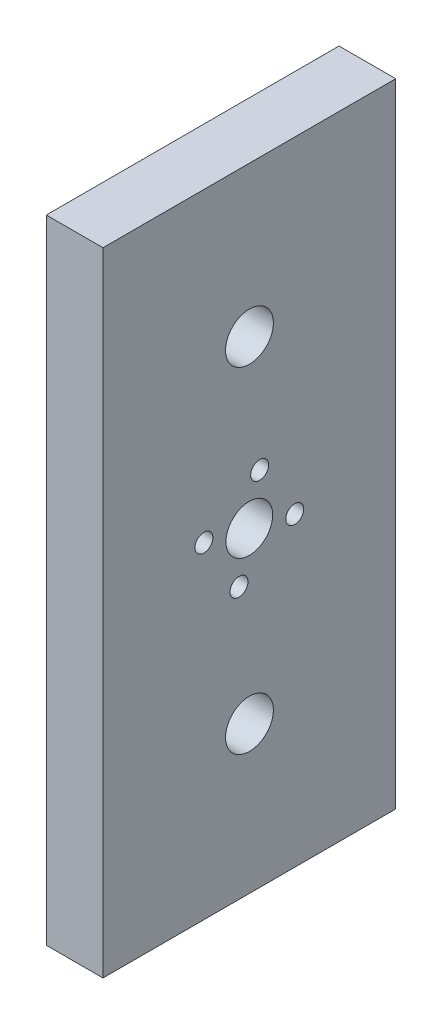
ISO-10303-21;
HEADER;
FILE_DESCRIPTION(('STEP AP214'),'2;1');
FILE_NAME('part.step','',(''),(''),'','','');
FILE_SCHEMA(('AUTOMOTIVE_DESIGN { 1 0 10303 214 1 1 1 1 }'));
ENDSEC;
DATA;
#1=APPLICATION_CONTEXT('core data for automotive mechanical design processes');
#2=APPLICATION_PROTOCOL_DEFINITION('international standard','automotive_design',2000,#1);
#3=PRODUCT_CONTEXT('',#1,'mechanical');
#4=PRODUCT('Part','Part','',(#3));
#5=PRODUCT_RELATED_PRODUCT_CATEGORY('part','',(#4));
#6=PRODUCT_DEFINITION_FORMATION('','',#4);
#7=PRODUCT_DEFINITION_CONTEXT('part definition',#1,'design');
#8=PRODUCT_DEFINITION('design','',#6,#7);
#9=PRODUCT_DEFINITION_SHAPE('','',#8);
#10=(LENGTH_UNIT() NAMED_UNIT(*) SI_UNIT(.MILLI.,.METRE.));
#11=(NAMED_UNIT(*) PLANE_ANGLE_UNIT() SI_UNIT($,.RADIAN.));
#12=(NAMED_UNIT(*) SI_UNIT($,.STERADIAN.) SOLID_ANGLE_UNIT());
#13=UNCERTAINTY_MEASURE_WITH_UNIT(LENGTH_MEASURE(1.E-05),#10,'distance_accuracy_value','');
#14=(GEOMETRIC_REPRESENTATION_CONTEXT(3) GLOBAL_UNCERTAINTY_ASSIGNED_CONTEXT((#13)) GLOBAL_UNIT_ASSIGNED_CONTEXT((#10,
#11,#12)) REPRESENTATION_CONTEXT('',''));
#15=CARTESIAN_POINT('',(0.,0.,0.));
#16=DIRECTION('',(0.,0.,1.));
#17=DIRECTION('',(1.,0.,0.));
#18=AXIS2_PLACEMENT_3D('',#15,#16,#17);
#19=CARTESIAN_POINT('',(10.,-434.064948576909,-442.796456133035));
#20=DIRECTION('',(0.,0.,1.));
#21=DIRECTION('',(1.,0.,0.));
#22=AXIS2_PLACEMENT_3D('',#19,#20,#21);
#23=PLANE('',#22);
#24=DIRECTION('',(0.,1.,0.));
#25=VECTOR('',#24,1.);
#26=CARTESIAN_POINT('',(0.,-434.064948576909,-442.796456133035));
#27=LINE('',#26,#25);
#28=CARTESIAN_POINT('',(0.,-545.69491443898,-442.796456133035));
#29=VERTEX_POINT('',#28);
#30=CARTESIAN_POINT('',(0.,-434.064948576909,-442.796456133035));
#31=VERTEX_POINT('',#30);
#32=EDGE_CURVE('E100',#29,#31,#27,.T.);
#33=ORIENTED_EDGE('',*,*,#32,.T.);
#34=DIRECTION('',(-1.,0.,0.));
#35=VECTOR('',#34,1.);
#36=CARTESIAN_POINT('',(10.,-434.064948576909,-442.796456133035));
#37=LINE('',#36,#35);
#38=CARTESIAN_POINT('',(10.,-434.064948576909,-442.796456133035));
#39=VERTEX_POINT('',#38);
#40=EDGE_CURVE('E11',#39,#31,#37,.T.);
#41=ORIENTED_EDGE('',*,*,#40,.F.);
#42=DIRECTION('',(0.,1.,0.));
#43=VECTOR('',#42,1.);
#44=CARTESIAN_POINT('',(10.,-434.064948576909,-442.796456133035));
#45=LINE('',#44,#43);
#46=CARTESIAN_POINT('',(10.,-545.69491443898,-442.796456133035));
#47=VERTEX_POINT('',#46);
#48=EDGE_CURVE('E88',#47,#39,#45,.T.);
#49=ORIENTED_EDGE('',*,*,#48,.F.);
#50=DIRECTION('',(-1.,0.,0.));
#51=VECTOR('',#50,1.);
#52=CARTESIAN_POINT('',(10.,-545.69491443898,-442.796456133035));
#53=LINE('',#52,#51);
#54=EDGE_CURVE('E96',#47,#29,#53,.T.);
#55=ORIENTED_EDGE('',*,*,#54,.T.);
#56=EDGE_LOOP('',(#33,#41,#49,#55));
#57=FACE_BOUND('',#56,.T.);
#58=ADVANCED_FACE('F37',(#57),#23,.F.);
#59=CARTESIAN_POINT('',(10.,-434.064948576909,-391.125660396535));
#60=DIRECTION('',(0.,-1.,0.));
#61=DIRECTION('',(0.,0.,-1.));
#62=AXIS2_PLACEMENT_3D('',#59,#60,#61);
#63=PLANE('',#62);
#64=DIRECTION('',(0.,0.,1.));
#65=VECTOR('',#64,1.);
#66=CARTESIAN_POINT('',(0.,-434.064948576909,-391.125660396535));
#67=LINE('',#66,#65);
#68=CARTESIAN_POINT('',(0.,-434.064948576909,-391.125660396535));
#69=VERTEX_POINT('',#68);
#70=EDGE_CURVE('E92',#31,#69,#67,.T.);
#71=ORIENTED_EDGE('',*,*,#70,.T.);
#72=DIRECTION('',(-1.,0.,0.));
#73=VECTOR('',#72,1.);
#74=CARTESIAN_POINT('',(10.,-434.064948576909,-391.125660396535));
#75=LINE('',#74,#73);
#76=CARTESIAN_POINT('',(10.,-434.064948576909,-391.125660396535));
#77=VERTEX_POINT('',#76);
#78=EDGE_CURVE('E45',#77,#69,#75,.T.);
#79=ORIENTED_EDGE('',*,*,#78,.F.);
#80=DIRECTION('',(0.,0.,1.));
#81=VECTOR('',#80,1.);
#82=CARTESIAN_POINT('',(10.,-434.064948576909,-391.125660396535));
#83=LINE('',#82,#81);
#84=EDGE_CURVE('E83',#39,#77,#83,.T.);
#85=ORIENTED_EDGE('',*,*,#84,.F.);
#86=ORIENTED_EDGE('',*,*,#40,.T.);
#87=EDGE_LOOP('',(#71,#79,#85,#86));
#88=FACE_BOUND('',#87,.T.);
#89=ADVANCED_FACE('F91',(#88),#63,.F.);
#90=CARTESIAN_POINT('',(10.,-434.064948576909,-391.125660396535));
#91=DIRECTION('',(0.,0.,-1.));
#92=DIRECTION('',(-1.,0.,0.));
#93=AXIS2_PLACEMENT_3D('',#90,#91,#92);
#94=PLANE('',#93);
#95=DIRECTION('',(0.,-1.,0.));
#96=VECTOR('',#95,1.);
#97=CARTESIAN_POINT('',(0.,-434.064948576909,-391.125660396535));
#98=LINE('',#97,#96);
#99=CARTESIAN_POINT('',(0.,-545.69491443898,-391.125660396535));
#100=VERTEX_POINT('',#99);
#101=EDGE_CURVE('E70',#69,#100,#98,.T.);
#102=ORIENTED_EDGE('',*,*,#101,.T.);
#103=DIRECTION('',(-1.,0.,0.));
#104=VECTOR('',#103,1.);
#105=CARTESIAN_POINT('',(10.,-545.69491443898,-391.125660396535));
#106=LINE('',#105,#104);
#107=CARTESIAN_POINT('',(10.,-545.69491443898,-391.125660396535));
#108=VERTEX_POINT('',#107);
#109=EDGE_CURVE('E93',#108,#100,#106,.T.);
#110=ORIENTED_EDGE('',*,*,#109,.F.);
#111=DIRECTION('',(0.,-1.,0.));
#112=VECTOR('',#111,1.);
#113=CARTESIAN_POINT('',(10.,-434.064948576909,-391.125660396535));
#114=LINE('',#113,#112);
#115=EDGE_CURVE('E86',#77,#108,#114,.T.);
#116=ORIENTED_EDGE('',*,*,#115,.F.);
#117=ORIENTED_EDGE('',*,*,#78,.T.);
#118=EDGE_LOOP('',(#102,#110,#116,#117));
#119=FACE_BOUND('',#118,.T.);
#120=ADVANCED_FACE('F94',(#119),#94,.F.);
#121=CARTESIAN_POINT('',(10.,-545.69491443898,-391.125660396535));
#122=DIRECTION('',(0.,1.,0.));
#123=DIRECTION('',(0.,0.,1.));
#124=AXIS2_PLACEMENT_3D('',#121,#122,#123);
#125=PLANE('',#124);
#126=DIRECTION('',(0.,0.,-1.));
#127=VECTOR('',#126,1.);
#128=CARTESIAN_POINT('',(0.,-545.69491443898,-391.125660396535));
#129=LINE('',#128,#127);
#130=EDGE_CURVE('E76',#100,#29,#129,.T.);
#131=ORIENTED_EDGE('',*,*,#130,.T.);
#132=ORIENTED_EDGE('',*,*,#54,.F.);
#133=DIRECTION('',(0.,0.,-1.));
#134=VECTOR('',#133,1.);
#135=CARTESIAN_POINT('',(10.,-545.69491443898,-391.125660396535));
#136=LINE('',#135,#134);
#137=EDGE_CURVE('E53',#108,#47,#136,.T.);
#138=ORIENTED_EDGE('',*,*,#137,.F.);
#139=ORIENTED_EDGE('',*,*,#109,.T.);
#140=EDGE_LOOP('',(#131,#132,#138,#139));
#141=FACE_BOUND('',#140,.T.);
#142=ADVANCED_FACE('F108',(#141),#125,.F.);
#143=CARTESIAN_POINT('',(10.,0.,0.));
#144=DIRECTION('',(1.,0.,0.));
#145=DIRECTION('',(0.,0.,-1.));
#146=AXIS2_PLACEMENT_3D('',#143,#144,#145);
#147=PLANE('',#146);
#148=CARTESIAN_POINT('',(10.,-481.859784241194,-418.785735610491));
#149=DIRECTION('',(1.,0.,0.));
#150=DIRECTION('',(0.,0.,-1.));
#151=AXIS2_PLACEMENT_3D('',#148,#149,#150);
#152=CIRCLE('',#151,1.58750000000004);
#153=CARTESIAN_POINT('',(10.,-481.859784241194,-420.373235610492));
#154=VERTEX_POINT('',#153);
#155=EDGE_CURVE('E150',#154,#154,#152,.T.);
#156=ORIENTED_EDGE('',*,*,#155,.F.);
#157=EDGE_LOOP('',(#156));
#158=FACE_BOUND('',#157,.T.);
#159=CARTESIAN_POINT('',(10.,-491.704497776385,-424.981126268878));
#160=DIRECTION('',(1.,0.,0.));
#161=DIRECTION('',(0.,0.,-1.));
#162=AXIS2_PLACEMENT_3D('',#159,#160,#161);
#163=CIRCLE('',#162,1.58750000000004);
#164=CARTESIAN_POINT('',(10.,-491.704497776385,-426.568626268878));
#165=VERTEX_POINT('',#164);
#166=EDGE_CURVE('E147',#165,#165,#163,.T.);
#167=ORIENTED_EDGE('',*,*,#166,.F.);
#168=EDGE_LOOP('',(#167));
#169=FACE_BOUND('',#168,.T.);
#170=CARTESIAN_POINT('',(10.,-497.899888434771,-415.136412733686));
#171=DIRECTION('',(1.,0.,0.));
#172=DIRECTION('',(0.,0.,-1.));
#173=AXIS2_PLACEMENT_3D('',#170,#171,#172);
#174=CIRCLE('',#173,1.58750000000004);
#175=CARTESIAN_POINT('',(10.,-497.899888434771,-416.723912733686));
#176=VERTEX_POINT('',#175);
#177=EDGE_CURVE('E141',#176,#176,#174,.T.);
#178=ORIENTED_EDGE('',*,*,#177,.F.);
#179=EDGE_LOOP('',(#178));
#180=FACE_BOUND('',#179,.T.);
#181=CARTESIAN_POINT('',(10.,-488.05517489958,-408.9410220753));
#182=DIRECTION('',(1.,0.,0.));
#183=DIRECTION('',(0.,0.,-1.));
#184=AXIS2_PLACEMENT_3D('',#181,#182,#183);
#185=CIRCLE('',#184,1.58750000000004);
#186=CARTESIAN_POINT('',(10.,-488.05517489958,-410.5285220753));
#187=VERTEX_POINT('',#186);
#188=EDGE_CURVE('E135',#187,#187,#185,.T.);
#189=ORIENTED_EDGE('',*,*,#188,.F.);
#190=EDGE_LOOP('',(#189));
#191=FACE_BOUND('',#190,.T.);
#192=CARTESIAN_POINT('',(10.,-460.578730031809,-416.982623845333));
#193=DIRECTION('',(1.,0.,0.));
#194=DIRECTION('',(0.,0.,-1.));
#195=AXIS2_PLACEMENT_3D('',#192,#193,#194);
#196=CIRCLE('',#195,4.225);
#197=CARTESIAN_POINT('',(10.,-460.578730031809,-421.207623845333));
#198=VERTEX_POINT('',#197);
#199=EDGE_CURVE('E127',#198,#198,#196,.T.);
#200=ORIENTED_EDGE('',*,*,#199,.F.);
#201=EDGE_LOOP('',(#200));
#202=FACE_BOUND('',#201,.T.);
#203=CARTESIAN_POINT('',(10.,-519.760730031808,-416.982623845334));
#204=DIRECTION('',(1.,0.,0.));
#205=DIRECTION('',(0.,0.,-1.));
#206=AXIS2_PLACEMENT_3D('',#203,#204,#205);
#207=CIRCLE('',#206,4.22499999999998);
#208=CARTESIAN_POINT('',(10.,-519.760730031808,-421.207623845334));
#209=VERTEX_POINT('',#208);
#210=EDGE_CURVE('E124',#209,#209,#207,.T.);
#211=ORIENTED_EDGE('',*,*,#210,.F.);
#212=EDGE_LOOP('',(#211));
#213=FACE_BOUND('',#212,.T.);
#214=CARTESIAN_POINT('',(10.,-489.879931507944,-416.961058264785));
#215=DIRECTION('',(1.,0.,0.));
#216=DIRECTION('',(0.,0.,-1.));
#217=AXIS2_PLACEMENT_3D('',#214,#215,#216);
#218=CIRCLE('',#217,4.1275);
#219=CARTESIAN_POINT('',(10.,-489.879931507944,-421.088558264785));
#220=VERTEX_POINT('',#219);
#221=EDGE_CURVE('E117',#220,#220,#218,.T.);
#222=ORIENTED_EDGE('',*,*,#221,.F.);
#223=EDGE_LOOP('',(#222));
#224=FACE_BOUND('',#223,.T.);
#225=ORIENTED_EDGE('',*,*,#48,.T.);
#226=ORIENTED_EDGE('',*,*,#84,.T.);
#227=ORIENTED_EDGE('',*,*,#115,.T.);
#228=ORIENTED_EDGE('',*,*,#137,.T.);
#229=EDGE_LOOP('',(#225,#226,#227,#228));
#230=FACE_BOUND('',#229,.T.);
#231=ADVANCED_FACE('F84',(#158,#169,#180,#191,#202,#213,#224,#230),#147,.T.);
#232=CARTESIAN_POINT('',(0.,0.,0.));
#233=DIRECTION('',(1.,0.,0.));
#234=DIRECTION('',(0.,0.,-1.));
#235=AXIS2_PLACEMENT_3D('',#232,#233,#234);
#236=PLANE('',#235);
#237=CARTESIAN_POINT('',(0.,-481.859784241194,-418.785735610491));
#238=DIRECTION('',(1.,0.,0.));
#239=DIRECTION('',(0.,0.,-1.));
#240=AXIS2_PLACEMENT_3D('',#237,#238,#239);
#241=CIRCLE('',#240,1.58750000000004);
#242=CARTESIAN_POINT('',(0.,-481.859784241194,-420.373235610492));
#243=VERTEX_POINT('',#242);
#244=EDGE_CURVE('E118',#243,#243,#241,.T.);
#245=ORIENTED_EDGE('',*,*,#244,.T.);
#246=EDGE_LOOP('',(#245));
#247=FACE_BOUND('',#246,.T.);
#248=CARTESIAN_POINT('',(0.,-491.704497776385,-424.981126268878));
#249=DIRECTION('',(1.,0.,0.));
#250=DIRECTION('',(0.,0.,-1.));
#251=AXIS2_PLACEMENT_3D('',#248,#249,#250);
#252=CIRCLE('',#251,1.58750000000004);
#253=CARTESIAN_POINT('',(0.,-491.704497776385,-426.568626268878));
#254=VERTEX_POINT('',#253);
#255=EDGE_CURVE('E144',#254,#254,#252,.T.);
#256=ORIENTED_EDGE('',*,*,#255,.T.);
#257=EDGE_LOOP('',(#256));
#258=FACE_BOUND('',#257,.T.);
#259=CARTESIAN_POINT('',(0.,-497.899888434771,-415.136412733686));
#260=DIRECTION('',(1.,0.,0.));
#261=DIRECTION('',(0.,0.,-1.));
#262=AXIS2_PLACEMENT_3D('',#259,#260,#261);
#263=CIRCLE('',#262,1.58750000000004);
#264=CARTESIAN_POINT('',(0.,-497.899888434771,-416.723912733686));
#265=VERTEX_POINT('',#264);
#266=EDGE_CURVE('E138',#265,#265,#263,.T.);
#267=ORIENTED_EDGE('',*,*,#266,.T.);
#268=EDGE_LOOP('',(#267));
#269=FACE_BOUND('',#268,.T.);
#270=CARTESIAN_POINT('',(0.,-488.05517489958,-408.9410220753));
#271=DIRECTION('',(1.,0.,0.));
#272=DIRECTION('',(0.,0.,-1.));
#273=AXIS2_PLACEMENT_3D('',#270,#271,#272);
#274=CIRCLE('',#273,1.58750000000004);
#275=CARTESIAN_POINT('',(0.,-488.05517489958,-410.5285220753));
#276=VERTEX_POINT('',#275);
#277=EDGE_CURVE('E132',#276,#276,#274,.T.);
#278=ORIENTED_EDGE('',*,*,#277,.T.);
#279=EDGE_LOOP('',(#278));
#280=FACE_BOUND('',#279,.T.);
#281=CARTESIAN_POINT('',(0.,-460.578730031809,-416.982623845333));
#282=DIRECTION('',(1.,0.,0.));
#283=DIRECTION('',(0.,0.,-1.));
#284=AXIS2_PLACEMENT_3D('',#281,#282,#283);
#285=CIRCLE('',#284,4.225);
#286=CARTESIAN_POINT('',(0.,-460.578730031809,-421.207623845333));
#287=VERTEX_POINT('',#286);
#288=EDGE_CURVE('E103',#287,#287,#285,.T.);
#289=ORIENTED_EDGE('',*,*,#288,.T.);
#290=EDGE_LOOP('',(#289));
#291=FACE_BOUND('',#290,.T.);
#292=CARTESIAN_POINT('',(0.,-519.760730031808,-416.982623845334));
#293=DIRECTION('',(1.,0.,0.));
#294=DIRECTION('',(0.,0.,-1.));
#295=AXIS2_PLACEMENT_3D('',#292,#293,#294);
#296=CIRCLE('',#295,4.22499999999998);
#297=CARTESIAN_POINT('',(0.,-519.760730031808,-421.207623845334));
#298=VERTEX_POINT('',#297);
#299=EDGE_CURVE('E121',#298,#298,#296,.T.);
#300=ORIENTED_EDGE('',*,*,#299,.T.);
#301=EDGE_LOOP('',(#300));
#302=FACE_BOUND('',#301,.T.);
#303=CARTESIAN_POINT('',(0.,-489.879931507944,-416.961058264785));
#304=DIRECTION('',(1.,0.,0.));
#305=DIRECTION('',(0.,0.,-1.));
#306=AXIS2_PLACEMENT_3D('',#303,#304,#305);
#307=CIRCLE('',#306,4.1275);
#308=CARTESIAN_POINT('',(0.,-489.879931507944,-421.088558264785));
#309=VERTEX_POINT('',#308);
#310=EDGE_CURVE('E114',#309,#309,#307,.T.);
#311=ORIENTED_EDGE('',*,*,#310,.T.);
#312=EDGE_LOOP('',(#311));
#313=FACE_BOUND('',#312,.T.);
#314=ORIENTED_EDGE('',*,*,#32,.F.);
#315=ORIENTED_EDGE('',*,*,#130,.F.);
#316=ORIENTED_EDGE('',*,*,#101,.F.);
#317=ORIENTED_EDGE('',*,*,#70,.F.);
#318=EDGE_LOOP('',(#314,#315,#316,#317));
#319=FACE_BOUND('',#318,.T.);
#320=ADVANCED_FACE('F111',(#247,#258,#269,#280,#291,#302,#313,#319),#236,.F.);
#321=CARTESIAN_POINT('',(0.,-489.879931507944,-416.961058264785));
#322=DIRECTION('',(1.,0.,0.));
#323=DIRECTION('',(0.,0.,-1.));
#324=AXIS2_PLACEMENT_3D('',#321,#322,#323);
#325=CYLINDRICAL_SURFACE('',#324,4.1275);
#326=ORIENTED_EDGE('',*,*,#310,.F.);
#327=EDGE_LOOP('',(#326));
#328=FACE_BOUND('',#327,.T.);
#329=ORIENTED_EDGE('',*,*,#221,.T.);
#330=EDGE_LOOP('',(#329));
#331=FACE_BOUND('',#330,.T.);
#332=ADVANCED_FACE('F180',(#328,#331),#325,.F.);
#333=CARTESIAN_POINT('',(0.,-519.760730031808,-416.982623845334));
#334=DIRECTION('',(1.,0.,0.));
#335=DIRECTION('',(0.,0.,-1.));
#336=AXIS2_PLACEMENT_3D('',#333,#334,#335);
#337=CYLINDRICAL_SURFACE('',#336,4.22499999999998);
#338=ORIENTED_EDGE('',*,*,#299,.F.);
#339=EDGE_LOOP('',(#338));
#340=FACE_BOUND('',#339,.T.);
#341=ORIENTED_EDGE('',*,*,#210,.T.);
#342=EDGE_LOOP('',(#341));
#343=FACE_BOUND('',#342,.T.);
#344=ADVANCED_FACE('F182',(#340,#343),#337,.F.);
#345=CARTESIAN_POINT('',(0.,-460.578730031809,-416.982623845333));
#346=DIRECTION('',(1.,0.,0.));
#347=DIRECTION('',(0.,0.,-1.));
#348=AXIS2_PLACEMENT_3D('',#345,#346,#347);
#349=CYLINDRICAL_SURFACE('',#348,4.225);
#350=ORIENTED_EDGE('',*,*,#288,.F.);
#351=EDGE_LOOP('',(#350));
#352=FACE_BOUND('',#351,.T.);
#353=ORIENTED_EDGE('',*,*,#199,.T.);
#354=EDGE_LOOP('',(#353));
#355=FACE_BOUND('',#354,.T.);
#356=ADVANCED_FACE('F189',(#352,#355),#349,.F.);
#357=CARTESIAN_POINT('',(0.,-488.05517489958,-408.9410220753));
#358=DIRECTION('',(1.,0.,0.));
#359=DIRECTION('',(0.,0.,-1.));
#360=AXIS2_PLACEMENT_3D('',#357,#358,#359);
#361=CYLINDRICAL_SURFACE('',#360,1.58750000000004);
#362=ORIENTED_EDGE('',*,*,#277,.F.);
#363=EDGE_LOOP('',(#362));
#364=FACE_BOUND('',#363,.T.);
#365=ORIENTED_EDGE('',*,*,#188,.T.);
#366=EDGE_LOOP('',(#365));
#367=FACE_BOUND('',#366,.T.);
#368=ADVANCED_FACE('F224',(#364,#367),#361,.F.);
#369=CARTESIAN_POINT('',(0.,-497.899888434771,-415.136412733686));
#370=DIRECTION('',(1.,0.,0.));
#371=DIRECTION('',(0.,0.,-1.));
#372=AXIS2_PLACEMENT_3D('',#369,#370,#371);
#373=CYLINDRICAL_SURFACE('',#372,1.58750000000004);
#374=ORIENTED_EDGE('',*,*,#266,.F.);
#375=EDGE_LOOP('',(#374));
#376=FACE_BOUND('',#375,.T.);
#377=ORIENTED_EDGE('',*,*,#177,.T.);
#378=EDGE_LOOP('',(#377));
#379=FACE_BOUND('',#378,.T.);
#380=ADVANCED_FACE('F229',(#376,#379),#373,.F.);
#381=CARTESIAN_POINT('',(0.,-491.704497776385,-424.981126268878));
#382=DIRECTION('',(1.,0.,0.));
#383=DIRECTION('',(0.,0.,-1.));
#384=AXIS2_PLACEMENT_3D('',#381,#382,#383);
#385=CYLINDRICAL_SURFACE('',#384,1.58750000000004);
#386=ORIENTED_EDGE('',*,*,#255,.F.);
#387=EDGE_LOOP('',(#386));
#388=FACE_BOUND('',#387,.T.);
#389=ORIENTED_EDGE('',*,*,#166,.T.);
#390=EDGE_LOOP('',(#389));
#391=FACE_BOUND('',#390,.T.);
#392=ADVANCED_FACE('F161',(#388,#391),#385,.F.);
#393=CARTESIAN_POINT('',(0.,-481.859784241194,-418.785735610491));
#394=DIRECTION('',(1.,0.,0.));
#395=DIRECTION('',(0.,0.,-1.));
#396=AXIS2_PLACEMENT_3D('',#393,#394,#395);
#397=CYLINDRICAL_SURFACE('',#396,1.58750000000004);
#398=ORIENTED_EDGE('',*,*,#244,.F.);
#399=EDGE_LOOP('',(#398));
#400=FACE_BOUND('',#399,.T.);
#401=ORIENTED_EDGE('',*,*,#155,.T.);
#402=EDGE_LOOP('',(#401));
#403=FACE_BOUND('',#402,.T.);
#404=ADVANCED_FACE('F158',(#400,#403),#397,.F.);
#405=CLOSED_SHELL('',(#58,#89,#120,#142,#231,#320,#332,#344,#356,#368,#380,#392,#404));
#406=MANIFOLD_SOLID_BREP('B2',#405);
#407=ADVANCED_BREP_SHAPE_REPRESENTATION('',(#18,#406),#14);
#408=SHAPE_DEFINITION_REPRESENTATION(#9,#407);
ENDSEC;
END-ISO-10303-21;
